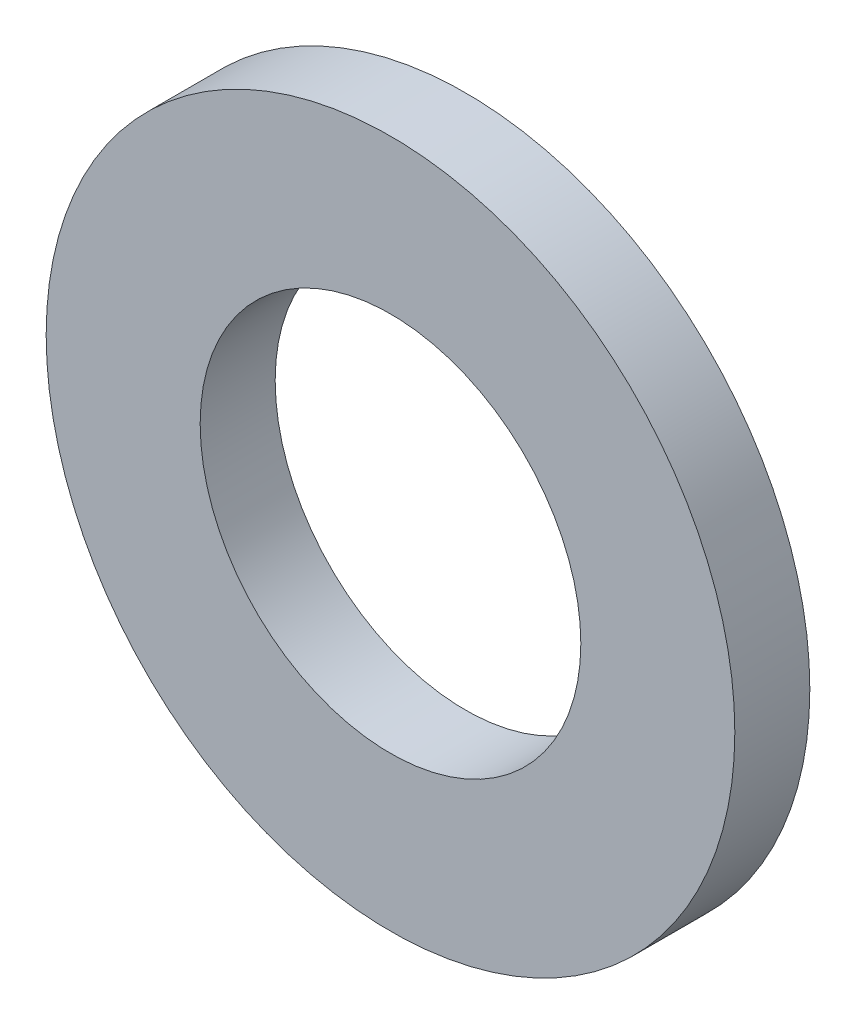
ISO-10303-21;
HEADER;
FILE_DESCRIPTION(('STEP AP214'),'2;1');
FILE_NAME('part.step','',(''),(''),'','','');
FILE_SCHEMA(('AUTOMOTIVE_DESIGN { 1 0 10303 214 1 1 1 1 }'));
ENDSEC;
DATA;
#1=APPLICATION_CONTEXT('core data for automotive mechanical design processes');
#2=APPLICATION_PROTOCOL_DEFINITION('international standard','automotive_design',2000,#1);
#3=PRODUCT_CONTEXT('',#1,'mechanical');
#4=PRODUCT('Part','Part','',(#3));
#5=PRODUCT_RELATED_PRODUCT_CATEGORY('part','',(#4));
#6=PRODUCT_DEFINITION_FORMATION('','',#4);
#7=PRODUCT_DEFINITION_CONTEXT('part definition',#1,'design');
#8=PRODUCT_DEFINITION('design','',#6,#7);
#9=PRODUCT_DEFINITION_SHAPE('','',#8);
#10=(LENGTH_UNIT() NAMED_UNIT(*) SI_UNIT(.MILLI.,.METRE.));
#11=(NAMED_UNIT(*) PLANE_ANGLE_UNIT() SI_UNIT($,.RADIAN.));
#12=(NAMED_UNIT(*) SI_UNIT($,.STERADIAN.) SOLID_ANGLE_UNIT());
#13=UNCERTAINTY_MEASURE_WITH_UNIT(LENGTH_MEASURE(1.E-05),#10,'distance_accuracy_value','');
#14=(GEOMETRIC_REPRESENTATION_CONTEXT(3) GLOBAL_UNCERTAINTY_ASSIGNED_CONTEXT((#13)) GLOBAL_UNIT_ASSIGNED_CONTEXT((#10,
#11,#12)) REPRESENTATION_CONTEXT('',''));
#15=CARTESIAN_POINT('',(0.,0.,0.));
#16=DIRECTION('',(0.,0.,1.));
#17=DIRECTION('',(1.,0.,0.));
#18=AXIS2_PLACEMENT_3D('',#15,#16,#17);
#19=CARTESIAN_POINT('',(0.,0.,4.064));
#20=DIRECTION('',(0.,0.,1.));
#21=DIRECTION('',(1.,0.,0.));
#22=AXIS2_PLACEMENT_3D('',#19,#20,#21);
#23=PLANE('',#22);
#24=CARTESIAN_POINT('',(0.,0.,4.064));
#25=DIRECTION('',(0.,0.,1.));
#26=DIRECTION('',(1.,0.,0.));
#27=AXIS2_PLACEMENT_3D('',#24,#25,#26);
#28=CIRCLE('',#27,10.3124);
#29=CARTESIAN_POINT('',(10.3124,0.,4.064));
#30=VERTEX_POINT('',#29);
#31=EDGE_CURVE('E27',#30,#30,#28,.F.);
#32=ORIENTED_EDGE('',*,*,#31,.T.);
#33=EDGE_LOOP('',(#32));
#34=FACE_BOUND('',#33,.T.);
#35=CARTESIAN_POINT('',(0.,0.,4.064));
#36=DIRECTION('',(0.,0.,1.));
#37=DIRECTION('',(1.,0.,0.));
#38=AXIS2_PLACEMENT_3D('',#35,#36,#37);
#39=CIRCLE('',#38,18.6563);
#40=CARTESIAN_POINT('',(18.6563,0.,4.064));
#41=VERTEX_POINT('',#40);
#42=EDGE_CURVE('E18',#41,#41,#39,.F.);
#43=ORIENTED_EDGE('',*,*,#42,.F.);
#44=EDGE_LOOP('',(#43));
#45=FACE_BOUND('',#44,.T.);
#46=ADVANCED_FACE('F15',(#34,#45),#23,.T.);
#47=CARTESIAN_POINT('',(0.,0.,0.));
#48=DIRECTION('',(0.,0.,1.));
#49=DIRECTION('',(1.,0.,0.));
#50=AXIS2_PLACEMENT_3D('',#47,#48,#49);
#51=CYLINDRICAL_SURFACE('',#50,18.6563);
#52=ORIENTED_EDGE('',*,*,#42,.T.);
#53=EDGE_LOOP('',(#52));
#54=FACE_BOUND('',#53,.T.);
#55=CARTESIAN_POINT('',(0.,0.,0.));
#56=DIRECTION('',(0.,0.,1.));
#57=DIRECTION('',(1.,0.,0.));
#58=AXIS2_PLACEMENT_3D('',#55,#56,#57);
#59=CIRCLE('',#58,18.6563);
#60=CARTESIAN_POINT('',(18.6563,0.,0.));
#61=VERTEX_POINT('',#60);
#62=EDGE_CURVE('E22',#61,#61,#59,.T.);
#63=ORIENTED_EDGE('',*,*,#62,.T.);
#64=EDGE_LOOP('',(#63));
#65=FACE_BOUND('',#64,.T.);
#66=ADVANCED_FACE('F35',(#54,#65),#51,.T.);
#67=CARTESIAN_POINT('',(0.,0.,0.));
#68=DIRECTION('',(0.,0.,1.));
#69=DIRECTION('',(1.,0.,0.));
#70=AXIS2_PLACEMENT_3D('',#67,#68,#69);
#71=CYLINDRICAL_SURFACE('',#70,10.3124);
#72=ORIENTED_EDGE('',*,*,#31,.F.);
#73=EDGE_LOOP('',(#72));
#74=FACE_BOUND('',#73,.T.);
#75=CARTESIAN_POINT('',(0.,0.,0.));
#76=DIRECTION('',(0.,0.,1.));
#77=DIRECTION('',(1.,0.,0.));
#78=AXIS2_PLACEMENT_3D('',#75,#76,#77);
#79=CIRCLE('',#78,10.3124);
#80=CARTESIAN_POINT('',(10.3124,0.,0.));
#81=VERTEX_POINT('',#80);
#82=EDGE_CURVE('E10',#81,#81,#79,.F.);
#83=ORIENTED_EDGE('',*,*,#82,.T.);
#84=EDGE_LOOP('',(#83));
#85=FACE_BOUND('',#84,.T.);
#86=ADVANCED_FACE('F43',(#74,#85),#71,.F.);
#87=CARTESIAN_POINT('',(0.,0.,0.));
#88=DIRECTION('',(0.,0.,1.));
#89=DIRECTION('',(1.,0.,0.));
#90=AXIS2_PLACEMENT_3D('',#87,#88,#89);
#91=PLANE('',#90);
#92=ORIENTED_EDGE('',*,*,#82,.F.);
#93=EDGE_LOOP('',(#92));
#94=FACE_BOUND('',#93,.T.);
#95=ORIENTED_EDGE('',*,*,#62,.F.);
#96=EDGE_LOOP('',(#95));
#97=FACE_BOUND('',#96,.T.);
#98=ADVANCED_FACE('F44',(#94,#97),#91,.F.);
#99=CLOSED_SHELL('',(#46,#66,#86,#98));
#100=MANIFOLD_SOLID_BREP('B1',#99);
#101=ADVANCED_BREP_SHAPE_REPRESENTATION('',(#18,#100),#14);
#102=SHAPE_DEFINITION_REPRESENTATION(#9,#101);
ENDSEC;
END-ISO-10303-21;
